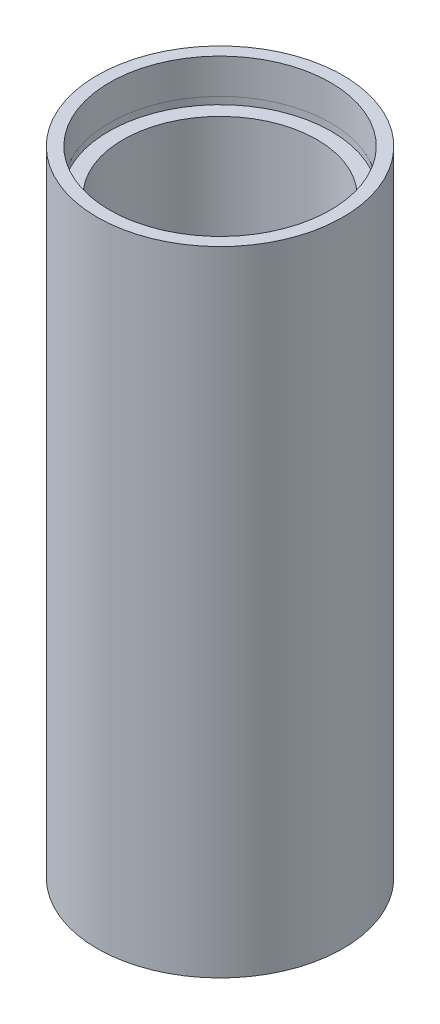
ISO-10303-21;
HEADER;
FILE_DESCRIPTION(('STEP AP214'),'2;1');
FILE_NAME('part.step','',(''),(''),'','','');
FILE_SCHEMA(('AUTOMOTIVE_DESIGN { 1 0 10303 214 1 1 1 1 }'));
ENDSEC;
DATA;
#1=APPLICATION_CONTEXT('core data for automotive mechanical design processes');
#2=APPLICATION_PROTOCOL_DEFINITION('international standard','automotive_design',2000,#1);
#3=PRODUCT_CONTEXT('',#1,'mechanical');
#4=PRODUCT('Part','Part','',(#3));
#5=PRODUCT_RELATED_PRODUCT_CATEGORY('part','',(#4));
#6=PRODUCT_DEFINITION_FORMATION('','',#4);
#7=PRODUCT_DEFINITION_CONTEXT('part definition',#1,'design');
#8=PRODUCT_DEFINITION('design','',#6,#7);
#9=PRODUCT_DEFINITION_SHAPE('','',#8);
#10=(LENGTH_UNIT() NAMED_UNIT(*) SI_UNIT(.MILLI.,.METRE.));
#11=(NAMED_UNIT(*) PLANE_ANGLE_UNIT() SI_UNIT($,.RADIAN.));
#12=(NAMED_UNIT(*) SI_UNIT($,.STERADIAN.) SOLID_ANGLE_UNIT());
#13=UNCERTAINTY_MEASURE_WITH_UNIT(LENGTH_MEASURE(1.E-05),#10,'distance_accuracy_value','');
#14=(GEOMETRIC_REPRESENTATION_CONTEXT(3) GLOBAL_UNCERTAINTY_ASSIGNED_CONTEXT((#13)) GLOBAL_UNIT_ASSIGNED_CONTEXT((#10,
#11,#12)) REPRESENTATION_CONTEXT('',''));
#15=CARTESIAN_POINT('',(0.,0.,0.));
#16=DIRECTION('',(0.,0.,1.));
#17=DIRECTION('',(1.,0.,0.));
#18=AXIS2_PLACEMENT_3D('',#15,#16,#17);
#19=CARTESIAN_POINT('',(13.75,0.,0.));
#20=DIRECTION('',(0.,1.,0.));
#21=DIRECTION('',(0.,0.,1.));
#22=AXIS2_PLACEMENT_3D('',#19,#20,#21);
#23=PLANE('',#22);
#24=CARTESIAN_POINT('',(0.,0.,0.));
#25=DIRECTION('',(0.,1.,0.));
#26=DIRECTION('',(0.,0.,1.));
#27=AXIS2_PLACEMENT_3D('',#24,#25,#26);
#28=CIRCLE('',#27,15.85);
#29=CARTESIAN_POINT('',(0.,0.,15.85));
#30=VERTEX_POINT('',#29);
#31=EDGE_CURVE('E10',#30,#30,#28,.T.);
#32=ORIENTED_EDGE('',*,*,#31,.F.);
#33=EDGE_LOOP('',(#32));
#34=FACE_BOUND('',#33,.T.);
#35=CARTESIAN_POINT('',(0.,0.,0.));
#36=DIRECTION('',(0.,1.,0.));
#37=DIRECTION('',(0.,0.,1.));
#38=AXIS2_PLACEMENT_3D('',#35,#36,#37);
#39=CIRCLE('',#38,13.75);
#40=CARTESIAN_POINT('',(0.,0.,13.75));
#41=VERTEX_POINT('',#40);
#42=EDGE_CURVE('E77',#41,#41,#39,.T.);
#43=ORIENTED_EDGE('',*,*,#42,.T.);
#44=EDGE_LOOP('',(#43));
#45=FACE_BOUND('',#44,.T.);
#46=ADVANCED_FACE('F37',(#34,#45),#23,.F.);
#47=CARTESIAN_POINT('',(0.,161.376166943427,0.));
#48=DIRECTION('',(0.,1.,0.));
#49=DIRECTION('',(0.,0.,1.));
#50=AXIS2_PLACEMENT_3D('',#47,#48,#49);
#51=CYLINDRICAL_SURFACE('',#50,15.85);
#52=CARTESIAN_POINT('',(0.,81.7,0.));
#53=DIRECTION('',(0.,1.,0.));
#54=DIRECTION('',(0.,0.,1.));
#55=AXIS2_PLACEMENT_3D('',#52,#53,#54);
#56=CIRCLE('',#55,15.85);
#57=CARTESIAN_POINT('',(0.,81.7,15.85));
#58=VERTEX_POINT('',#57);
#59=EDGE_CURVE('E43',#58,#58,#56,.T.);
#60=ORIENTED_EDGE('',*,*,#59,.F.);
#61=EDGE_LOOP('',(#60));
#62=FACE_BOUND('',#61,.T.);
#63=ORIENTED_EDGE('',*,*,#31,.T.);
#64=EDGE_LOOP('',(#63));
#65=FACE_BOUND('',#64,.T.);
#66=ADVANCED_FACE('F138',(#62,#65),#51,.T.);
#67=CARTESIAN_POINT('',(15.85,81.7,0.));
#68=DIRECTION('',(0.,-1.,0.));
#69=DIRECTION('',(0.,0.,-1.));
#70=AXIS2_PLACEMENT_3D('',#67,#68,#69);
#71=PLANE('',#70);
#72=CARTESIAN_POINT('',(0.,81.7,0.));
#73=DIRECTION('',(0.,1.,0.));
#74=DIRECTION('',(0.,0.,1.));
#75=AXIS2_PLACEMENT_3D('',#72,#73,#74);
#76=CIRCLE('',#75,14.25);
#77=CARTESIAN_POINT('',(0.,81.7,14.25));
#78=VERTEX_POINT('',#77);
#79=EDGE_CURVE('E47',#78,#78,#76,.T.);
#80=ORIENTED_EDGE('',*,*,#79,.F.);
#81=EDGE_LOOP('',(#80));
#82=FACE_BOUND('',#81,.T.);
#83=ORIENTED_EDGE('',*,*,#59,.T.);
#84=EDGE_LOOP('',(#83));
#85=FACE_BOUND('',#84,.T.);
#86=ADVANCED_FACE('F133',(#82,#85),#71,.F.);
#87=CARTESIAN_POINT('',(0.,161.376166943427,0.));
#88=DIRECTION('',(0.,1.,0.));
#89=DIRECTION('',(0.,0.,1.));
#90=AXIS2_PLACEMENT_3D('',#87,#88,#89);
#91=CYLINDRICAL_SURFACE('',#90,14.25);
#92=CARTESIAN_POINT('',(0.,77.2,0.));
#93=DIRECTION('',(0.,1.,0.));
#94=DIRECTION('',(0.,0.,1.));
#95=AXIS2_PLACEMENT_3D('',#92,#93,#94);
#96=CIRCLE('',#95,14.25);
#97=CARTESIAN_POINT('',(0.,77.2,14.25));
#98=VERTEX_POINT('',#97);
#99=EDGE_CURVE('E51',#98,#98,#96,.T.);
#100=ORIENTED_EDGE('',*,*,#99,.F.);
#101=EDGE_LOOP('',(#100));
#102=FACE_BOUND('',#101,.T.);
#103=ORIENTED_EDGE('',*,*,#79,.T.);
#104=EDGE_LOOP('',(#103));
#105=FACE_BOUND('',#104,.T.);
#106=ADVANCED_FACE('F127',(#102,#105),#91,.F.);
#107=CARTESIAN_POINT('',(14.25,77.2,0.));
#108=DIRECTION('',(0.,1.,0.));
#109=DIRECTION('',(0.,0.,1.));
#110=AXIS2_PLACEMENT_3D('',#107,#108,#109);
#111=PLANE('',#110);
#112=CARTESIAN_POINT('',(0.,77.2,0.));
#113=DIRECTION('',(0.,1.,0.));
#114=DIRECTION('',(0.,0.,1.));
#115=AXIS2_PLACEMENT_3D('',#112,#113,#114);
#116=CIRCLE('',#115,14.35);
#117=CARTESIAN_POINT('',(0.,77.2,14.35));
#118=VERTEX_POINT('',#117);
#119=EDGE_CURVE('E56',#118,#118,#116,.T.);
#120=ORIENTED_EDGE('',*,*,#119,.F.);
#121=EDGE_LOOP('',(#120));
#122=FACE_BOUND('',#121,.T.);
#123=ORIENTED_EDGE('',*,*,#99,.T.);
#124=EDGE_LOOP('',(#123));
#125=FACE_BOUND('',#124,.T.);
#126=ADVANCED_FACE('F121',(#122,#125),#111,.F.);
#127=CARTESIAN_POINT('',(0.,161.376166943427,0.));
#128=DIRECTION('',(0.,1.,0.));
#129=DIRECTION('',(0.,0.,1.));
#130=AXIS2_PLACEMENT_3D('',#127,#128,#129);
#131=CYLINDRICAL_SURFACE('',#130,14.35);
#132=CARTESIAN_POINT('',(0.,76.2,0.));
#133=DIRECTION('',(0.,1.,0.));
#134=DIRECTION('',(0.,0.,1.));
#135=AXIS2_PLACEMENT_3D('',#132,#133,#134);
#136=CIRCLE('',#135,14.35);
#137=CARTESIAN_POINT('',(0.,76.2,14.35));
#138=VERTEX_POINT('',#137);
#139=EDGE_CURVE('E59',#138,#138,#136,.T.);
#140=ORIENTED_EDGE('',*,*,#139,.F.);
#141=EDGE_LOOP('',(#140));
#142=FACE_BOUND('',#141,.T.);
#143=ORIENTED_EDGE('',*,*,#119,.T.);
#144=EDGE_LOOP('',(#143));
#145=FACE_BOUND('',#144,.T.);
#146=ADVANCED_FACE('F115',(#142,#145),#131,.F.);
#147=CARTESIAN_POINT('',(12.5,76.2,0.));
#148=DIRECTION('',(0.,-1.,0.));
#149=DIRECTION('',(0.,0.,-1.));
#150=AXIS2_PLACEMENT_3D('',#147,#148,#149);
#151=PLANE('',#150);
#152=CARTESIAN_POINT('',(0.,76.2,0.));
#153=DIRECTION('',(0.,1.,0.));
#154=DIRECTION('',(0.,0.,1.));
#155=AXIS2_PLACEMENT_3D('',#152,#153,#154);
#156=CIRCLE('',#155,12.5);
#157=CARTESIAN_POINT('',(0.,76.2,12.5));
#158=VERTEX_POINT('',#157);
#159=EDGE_CURVE('E62',#158,#158,#156,.T.);
#160=ORIENTED_EDGE('',*,*,#159,.F.);
#161=EDGE_LOOP('',(#160));
#162=FACE_BOUND('',#161,.T.);
#163=ORIENTED_EDGE('',*,*,#139,.T.);
#164=EDGE_LOOP('',(#163));
#165=FACE_BOUND('',#164,.T.);
#166=ADVANCED_FACE('F109',(#162,#165),#151,.F.);
#167=CARTESIAN_POINT('',(0.,161.376166943427,0.));
#168=DIRECTION('',(0.,1.,0.));
#169=DIRECTION('',(0.,0.,1.));
#170=AXIS2_PLACEMENT_3D('',#167,#168,#169);
#171=CYLINDRICAL_SURFACE('',#170,12.5);
#172=CARTESIAN_POINT('',(0.,5.49999999999998,0.));
#173=DIRECTION('',(0.,1.,0.));
#174=DIRECTION('',(0.,0.,1.));
#175=AXIS2_PLACEMENT_3D('',#172,#173,#174);
#176=CIRCLE('',#175,12.5);
#177=CARTESIAN_POINT('',(0.,5.49999999999998,12.5));
#178=VERTEX_POINT('',#177);
#179=EDGE_CURVE('E65',#178,#178,#176,.T.);
#180=ORIENTED_EDGE('',*,*,#179,.F.);
#181=EDGE_LOOP('',(#180));
#182=FACE_BOUND('',#181,.T.);
#183=ORIENTED_EDGE('',*,*,#159,.T.);
#184=EDGE_LOOP('',(#183));
#185=FACE_BOUND('',#184,.T.);
#186=ADVANCED_FACE('F103',(#182,#185),#171,.F.);
#187=CARTESIAN_POINT('',(12.5,5.49999999999998,0.));
#188=DIRECTION('',(0.,1.,0.));
#189=DIRECTION('',(0.,0.,1.));
#190=AXIS2_PLACEMENT_3D('',#187,#188,#189);
#191=PLANE('',#190);
#192=CARTESIAN_POINT('',(0.,5.49999999999998,0.));
#193=DIRECTION('',(0.,1.,0.));
#194=DIRECTION('',(0.,0.,1.));
#195=AXIS2_PLACEMENT_3D('',#192,#193,#194);
#196=CIRCLE('',#195,14.35);
#197=CARTESIAN_POINT('',(0.,5.49999999999998,14.35));
#198=VERTEX_POINT('',#197);
#199=EDGE_CURVE('E68',#198,#198,#196,.T.);
#200=ORIENTED_EDGE('',*,*,#199,.F.);
#201=EDGE_LOOP('',(#200));
#202=FACE_BOUND('',#201,.T.);
#203=ORIENTED_EDGE('',*,*,#179,.T.);
#204=EDGE_LOOP('',(#203));
#205=FACE_BOUND('',#204,.T.);
#206=ADVANCED_FACE('F97',(#202,#205),#191,.F.);
#207=CARTESIAN_POINT('',(0.,161.376166943427,0.));
#208=DIRECTION('',(0.,1.,0.));
#209=DIRECTION('',(0.,0.,1.));
#210=AXIS2_PLACEMENT_3D('',#207,#208,#209);
#211=CYLINDRICAL_SURFACE('',#210,14.35);
#212=CARTESIAN_POINT('',(0.,4.49999999999998,0.));
#213=DIRECTION('',(0.,1.,0.));
#214=DIRECTION('',(0.,0.,1.));
#215=AXIS2_PLACEMENT_3D('',#212,#213,#214);
#216=CIRCLE('',#215,14.35);
#217=CARTESIAN_POINT('',(0.,4.49999999999998,14.35));
#218=VERTEX_POINT('',#217);
#219=EDGE_CURVE('E71',#218,#218,#216,.T.);
#220=ORIENTED_EDGE('',*,*,#219,.F.);
#221=EDGE_LOOP('',(#220));
#222=FACE_BOUND('',#221,.T.);
#223=ORIENTED_EDGE('',*,*,#199,.T.);
#224=EDGE_LOOP('',(#223));
#225=FACE_BOUND('',#224,.T.);
#226=ADVANCED_FACE('F91',(#222,#225),#211,.F.);
#227=CARTESIAN_POINT('',(13.75,4.49999999999998,0.));
#228=DIRECTION('',(0.,-1.,0.));
#229=DIRECTION('',(0.,0.,-1.));
#230=AXIS2_PLACEMENT_3D('',#227,#228,#229);
#231=PLANE('',#230);
#232=CARTESIAN_POINT('',(0.,4.49999999999998,0.));
#233=DIRECTION('',(0.,1.,0.));
#234=DIRECTION('',(0.,0.,1.));
#235=AXIS2_PLACEMENT_3D('',#232,#233,#234);
#236=CIRCLE('',#235,13.75);
#237=CARTESIAN_POINT('',(0.,4.49999999999998,13.75));
#238=VERTEX_POINT('',#237);
#239=EDGE_CURVE('E74',#238,#238,#236,.T.);
#240=ORIENTED_EDGE('',*,*,#239,.F.);
#241=EDGE_LOOP('',(#240));
#242=FACE_BOUND('',#241,.T.);
#243=ORIENTED_EDGE('',*,*,#219,.T.);
#244=EDGE_LOOP('',(#243));
#245=FACE_BOUND('',#244,.T.);
#246=ADVANCED_FACE('F85',(#242,#245),#231,.F.);
#247=CARTESIAN_POINT('',(0.,161.376166943427,0.));
#248=DIRECTION('',(0.,1.,0.));
#249=DIRECTION('',(0.,0.,1.));
#250=AXIS2_PLACEMENT_3D('',#247,#248,#249);
#251=CYLINDRICAL_SURFACE('',#250,13.75);
#252=ORIENTED_EDGE('',*,*,#42,.F.);
#253=EDGE_LOOP('',(#252));
#254=FACE_BOUND('',#253,.T.);
#255=ORIENTED_EDGE('',*,*,#239,.T.);
#256=EDGE_LOOP('',(#255));
#257=FACE_BOUND('',#256,.T.);
#258=ADVANCED_FACE('F82',(#254,#257),#251,.F.);
#259=CLOSED_SHELL('',(#46,#66,#86,#106,#126,#146,#166,#186,#206,#226,#246,#258));
#260=MANIFOLD_SOLID_BREP('B2',#259);
#261=ADVANCED_BREP_SHAPE_REPRESENTATION('',(#18,#260),#14);
#262=SHAPE_DEFINITION_REPRESENTATION(#9,#261);
ENDSEC;
END-ISO-10303-21;
